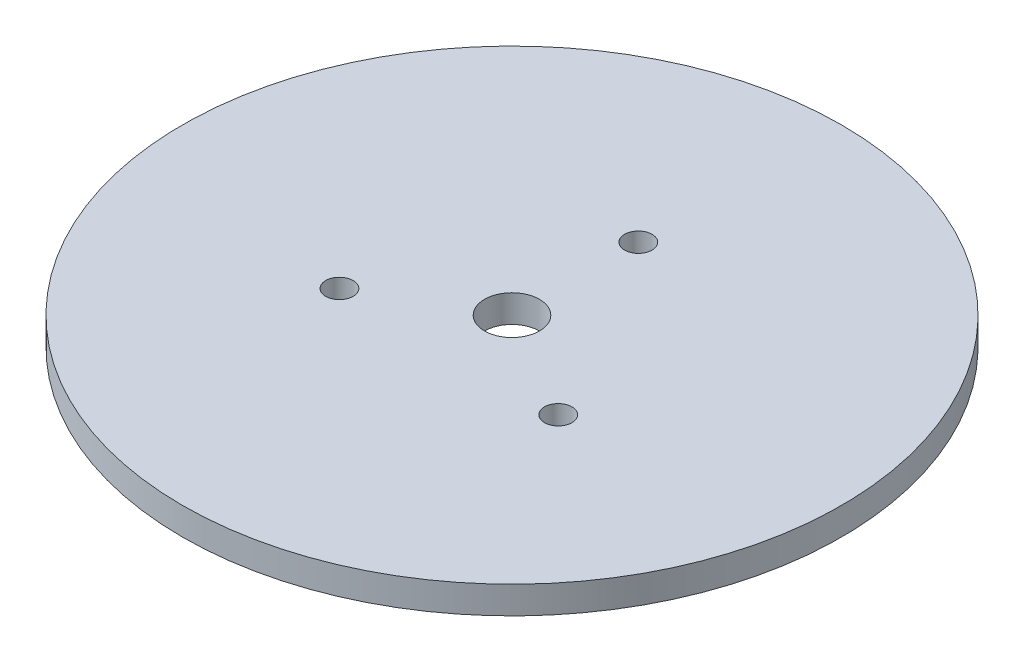
ISO-10303-21;
HEADER;
FILE_DESCRIPTION(('STEP AP214'),'2;1');
FILE_NAME('part.step','',(''),(''),'','','');
FILE_SCHEMA(('AUTOMOTIVE_DESIGN { 1 0 10303 214 1 1 1 1 }'));
ENDSEC;
DATA;
#1=APPLICATION_CONTEXT('core data for automotive mechanical design processes');
#2=APPLICATION_PROTOCOL_DEFINITION('international standard','automotive_design',2000,#1);
#3=PRODUCT_CONTEXT('',#1,'mechanical');
#4=PRODUCT('Part','Part','',(#3));
#5=PRODUCT_RELATED_PRODUCT_CATEGORY('part','',(#4));
#6=PRODUCT_DEFINITION_FORMATION('','',#4);
#7=PRODUCT_DEFINITION_CONTEXT('part definition',#1,'design');
#8=PRODUCT_DEFINITION('design','',#6,#7);
#9=PRODUCT_DEFINITION_SHAPE('','',#8);
#10=(LENGTH_UNIT() NAMED_UNIT(*) SI_UNIT(.MILLI.,.METRE.));
#11=(NAMED_UNIT(*) PLANE_ANGLE_UNIT() SI_UNIT($,.RADIAN.));
#12=(NAMED_UNIT(*) SI_UNIT($,.STERADIAN.) SOLID_ANGLE_UNIT());
#13=UNCERTAINTY_MEASURE_WITH_UNIT(LENGTH_MEASURE(1.E-05),#10,'distance_accuracy_value','');
#14=(GEOMETRIC_REPRESENTATION_CONTEXT(3) GLOBAL_UNCERTAINTY_ASSIGNED_CONTEXT((#13)) GLOBAL_UNIT_ASSIGNED_CONTEXT((#10,
#11,#12)) REPRESENTATION_CONTEXT('',''));
#15=CARTESIAN_POINT('',(0.,0.,0.));
#16=DIRECTION('',(0.,0.,1.));
#17=DIRECTION('',(1.,0.,0.));
#18=AXIS2_PLACEMENT_3D('',#15,#16,#17);
#19=CARTESIAN_POINT('',(0.,5.,0.));
#20=DIRECTION('',(0.,1.,0.));
#21=DIRECTION('',(0.,0.,1.));
#22=AXIS2_PLACEMENT_3D('',#19,#20,#21);
#23=PLANE('',#22);
#24=CARTESIAN_POINT('',(19.9185842870422,5.,11.4999999999999));
#25=DIRECTION('',(0.,1.,0.));
#26=DIRECTION('',(0.,0.,1.));
#27=AXIS2_PLACEMENT_3D('',#24,#25,#26);
#28=CIRCLE('',#27,2.49999999999983);
#29=CARTESIAN_POINT('',(19.9185842870422,5.,13.9999999999997));
#30=VERTEX_POINT('',#29);
#31=EDGE_CURVE('E55',#30,#30,#28,.T.);
#32=ORIENTED_EDGE('',*,*,#31,.F.);
#33=EDGE_LOOP('',(#32));
#34=FACE_BOUND('',#33,.T.);
#35=CARTESIAN_POINT('',(0.,5.,0.));
#36=DIRECTION('',(0.,1.,0.));
#37=DIRECTION('',(0.,0.,1.));
#38=AXIS2_PLACEMENT_3D('',#35,#36,#37);
#39=CIRCLE('',#38,5.);
#40=CARTESIAN_POINT('',(0.,5.,5.));
#41=VERTEX_POINT('',#40);
#42=EDGE_CURVE('E44',#41,#41,#39,.T.);
#43=ORIENTED_EDGE('',*,*,#42,.F.);
#44=EDGE_LOOP('',(#43));
#45=FACE_BOUND('',#44,.T.);
#46=CARTESIAN_POINT('',(0.,5.,0.));
#47=DIRECTION('',(0.,1.,0.));
#48=DIRECTION('',(0.,0.,1.));
#49=AXIS2_PLACEMENT_3D('',#46,#47,#48);
#50=CIRCLE('',#49,60.);
#51=CARTESIAN_POINT('',(0.,5.,60.));
#52=VERTEX_POINT('',#51);
#53=EDGE_CURVE('E10',#52,#52,#50,.T.);
#54=ORIENTED_EDGE('',*,*,#53,.T.);
#55=EDGE_LOOP('',(#54));
#56=FACE_BOUND('',#55,.T.);
#57=CARTESIAN_POINT('',(0.,5.,-23.));
#58=DIRECTION('',(0.,1.,0.));
#59=DIRECTION('',(0.,0.,1.));
#60=AXIS2_PLACEMENT_3D('',#57,#58,#59);
#61=CIRCLE('',#60,2.5);
#62=CARTESIAN_POINT('',(0.,5.,-20.5));
#63=VERTEX_POINT('',#62);
#64=EDGE_CURVE('E49',#63,#63,#61,.T.);
#65=ORIENTED_EDGE('',*,*,#64,.F.);
#66=EDGE_LOOP('',(#65));
#67=FACE_BOUND('',#66,.T.);
#68=CARTESIAN_POINT('',(-19.9185842870422,5.,11.4999999999998));
#69=DIRECTION('',(0.,1.,0.));
#70=DIRECTION('',(0.,0.,1.));
#71=AXIS2_PLACEMENT_3D('',#68,#69,#70);
#72=CIRCLE('',#71,2.5);
#73=CARTESIAN_POINT('',(-19.9185842870422,5.,13.9999999999998));
#74=VERTEX_POINT('',#73);
#75=EDGE_CURVE('E61',#74,#74,#72,.T.);
#76=ORIENTED_EDGE('',*,*,#75,.F.);
#77=EDGE_LOOP('',(#76));
#78=FACE_BOUND('',#77,.T.);
#79=ADVANCED_FACE('F33',(#34,#45,#56,#67,#78),#23,.T.);
#80=CARTESIAN_POINT('',(0.,0.,0.));
#81=DIRECTION('',(0.,1.,0.));
#82=DIRECTION('',(0.,0.,1.));
#83=AXIS2_PLACEMENT_3D('',#80,#81,#82);
#84=PLANE('',#83);
#85=CARTESIAN_POINT('',(0.,0.,0.));
#86=DIRECTION('',(0.,1.,0.));
#87=DIRECTION('',(0.,0.,1.));
#88=AXIS2_PLACEMENT_3D('',#85,#86,#87);
#89=CIRCLE('',#88,60.);
#90=CARTESIAN_POINT('',(0.,0.,60.));
#91=VERTEX_POINT('',#90);
#92=EDGE_CURVE('E37',#91,#91,#89,.T.);
#93=ORIENTED_EDGE('',*,*,#92,.F.);
#94=EDGE_LOOP('',(#93));
#95=FACE_BOUND('',#94,.T.);
#96=CARTESIAN_POINT('',(0.,0.,0.));
#97=DIRECTION('',(0.,1.,0.));
#98=DIRECTION('',(0.,0.,1.));
#99=AXIS2_PLACEMENT_3D('',#96,#97,#98);
#100=CIRCLE('',#99,5.);
#101=CARTESIAN_POINT('',(0.,0.,5.));
#102=VERTEX_POINT('',#101);
#103=EDGE_CURVE('E46',#102,#102,#100,.T.);
#104=ORIENTED_EDGE('',*,*,#103,.T.);
#105=EDGE_LOOP('',(#104));
#106=FACE_BOUND('',#105,.T.);
#107=CARTESIAN_POINT('',(0.,0.,-23.));
#108=DIRECTION('',(0.,1.,0.));
#109=DIRECTION('',(0.,0.,1.));
#110=AXIS2_PLACEMENT_3D('',#107,#108,#109);
#111=CIRCLE('',#110,2.5);
#112=CARTESIAN_POINT('',(0.,0.,-20.5));
#113=VERTEX_POINT('',#112);
#114=EDGE_CURVE('E52',#113,#113,#111,.T.);
#115=ORIENTED_EDGE('',*,*,#114,.T.);
#116=EDGE_LOOP('',(#115));
#117=FACE_BOUND('',#116,.T.);
#118=CARTESIAN_POINT('',(19.9185842870422,0.,11.4999999999999));
#119=DIRECTION('',(0.,1.,0.));
#120=DIRECTION('',(0.,0.,1.));
#121=AXIS2_PLACEMENT_3D('',#118,#119,#120);
#122=CIRCLE('',#121,2.49999999999983);
#123=CARTESIAN_POINT('',(19.9185842870422,0.,13.9999999999997));
#124=VERTEX_POINT('',#123);
#125=EDGE_CURVE('E58',#124,#124,#122,.T.);
#126=ORIENTED_EDGE('',*,*,#125,.T.);
#127=EDGE_LOOP('',(#126));
#128=FACE_BOUND('',#127,.T.);
#129=CARTESIAN_POINT('',(-19.9185842870422,0.,11.4999999999998));
#130=DIRECTION('',(0.,1.,0.));
#131=DIRECTION('',(0.,0.,1.));
#132=AXIS2_PLACEMENT_3D('',#129,#130,#131);
#133=CIRCLE('',#132,2.5);
#134=CARTESIAN_POINT('',(-19.9185842870422,0.,13.9999999999998));
#135=VERTEX_POINT('',#134);
#136=EDGE_CURVE('E64',#135,#135,#133,.T.);
#137=ORIENTED_EDGE('',*,*,#136,.T.);
#138=EDGE_LOOP('',(#137));
#139=FACE_BOUND('',#138,.T.);
#140=ADVANCED_FACE('F74',(#95,#106,#117,#128,#139),#84,.F.);
#141=CARTESIAN_POINT('',(0.,5.,0.));
#142=DIRECTION('',(0.,-1.,0.));
#143=DIRECTION('',(0.,0.,-1.));
#144=AXIS2_PLACEMENT_3D('',#141,#142,#143);
#145=CYLINDRICAL_SURFACE('',#144,60.);
#146=ORIENTED_EDGE('',*,*,#53,.F.);
#147=EDGE_LOOP('',(#146));
#148=FACE_BOUND('',#147,.T.);
#149=ORIENTED_EDGE('',*,*,#92,.T.);
#150=EDGE_LOOP('',(#149));
#151=FACE_BOUND('',#150,.T.);
#152=ADVANCED_FACE('F35',(#148,#151),#145,.T.);
#153=CARTESIAN_POINT('',(0.,5.,0.));
#154=DIRECTION('',(0.,-1.,0.));
#155=DIRECTION('',(0.,0.,-1.));
#156=AXIS2_PLACEMENT_3D('',#153,#154,#155);
#157=CYLINDRICAL_SURFACE('',#156,5.);
#158=ORIENTED_EDGE('',*,*,#42,.T.);
#159=EDGE_LOOP('',(#158));
#160=FACE_BOUND('',#159,.T.);
#161=ORIENTED_EDGE('',*,*,#103,.F.);
#162=EDGE_LOOP('',(#161));
#163=FACE_BOUND('',#162,.T.);
#164=ADVANCED_FACE('F84',(#160,#163),#157,.F.);
#165=CARTESIAN_POINT('',(0.,5.,-23.));
#166=DIRECTION('',(0.,-1.,0.));
#167=DIRECTION('',(0.,0.,-1.));
#168=AXIS2_PLACEMENT_3D('',#165,#166,#167);
#169=CYLINDRICAL_SURFACE('',#168,2.5);
#170=ORIENTED_EDGE('',*,*,#64,.T.);
#171=EDGE_LOOP('',(#170));
#172=FACE_BOUND('',#171,.T.);
#173=ORIENTED_EDGE('',*,*,#114,.F.);
#174=EDGE_LOOP('',(#173));
#175=FACE_BOUND('',#174,.T.);
#176=ADVANCED_FACE('F87',(#172,#175),#169,.F.);
#177=CARTESIAN_POINT('',(19.9185842870422,5.,11.4999999999999));
#178=DIRECTION('',(0.,-1.,0.));
#179=DIRECTION('',(0.,0.,-1.));
#180=AXIS2_PLACEMENT_3D('',#177,#178,#179);
#181=CYLINDRICAL_SURFACE('',#180,2.49999999999983);
#182=ORIENTED_EDGE('',*,*,#31,.T.);
#183=EDGE_LOOP('',(#182));
#184=FACE_BOUND('',#183,.T.);
#185=ORIENTED_EDGE('',*,*,#125,.F.);
#186=EDGE_LOOP('',(#185));
#187=FACE_BOUND('',#186,.T.);
#188=ADVANCED_FACE('F91',(#184,#187),#181,.F.);
#189=CARTESIAN_POINT('',(-19.9185842870422,5.,11.4999999999998));
#190=DIRECTION('',(0.,-1.,0.));
#191=DIRECTION('',(0.,0.,-1.));
#192=AXIS2_PLACEMENT_3D('',#189,#190,#191);
#193=CYLINDRICAL_SURFACE('',#192,2.5);
#194=ORIENTED_EDGE('',*,*,#75,.T.);
#195=EDGE_LOOP('',(#194));
#196=FACE_BOUND('',#195,.T.);
#197=ORIENTED_EDGE('',*,*,#136,.F.);
#198=EDGE_LOOP('',(#197));
#199=FACE_BOUND('',#198,.T.);
#200=ADVANCED_FACE('F70',(#196,#199),#193,.F.);
#201=CLOSED_SHELL('',(#79,#140,#152,#164,#176,#188,#200));
#202=MANIFOLD_SOLID_BREP('B2',#201);
#203=ADVANCED_BREP_SHAPE_REPRESENTATION('',(#18,#202),#14);
#204=SHAPE_DEFINITION_REPRESENTATION(#9,#203);
ENDSEC;
END-ISO-10303-21;
